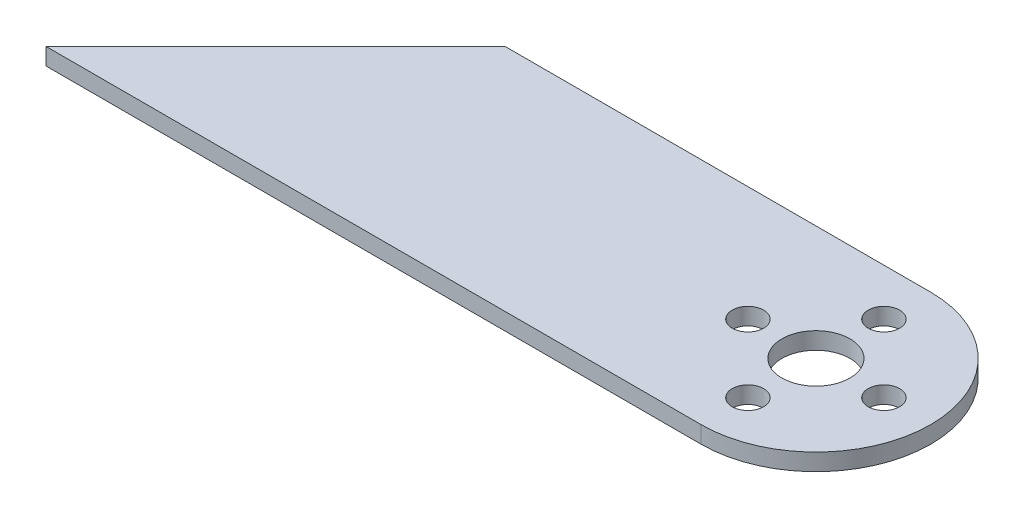
ISO-10303-21;
HEADER;
FILE_DESCRIPTION(('STEP AP214'),'2;1');
FILE_NAME('part.step','',(''),(''),'','','');
FILE_SCHEMA(('AUTOMOTIVE_DESIGN { 1 0 10303 214 1 1 1 1 }'));
ENDSEC;
DATA;
#1=APPLICATION_CONTEXT('core data for automotive mechanical design processes');
#2=APPLICATION_PROTOCOL_DEFINITION('international standard','automotive_design',2000,#1);
#3=PRODUCT_CONTEXT('',#1,'mechanical');
#4=PRODUCT('Part','Part','',(#3));
#5=PRODUCT_RELATED_PRODUCT_CATEGORY('part','',(#4));
#6=PRODUCT_DEFINITION_FORMATION('','',#4);
#7=PRODUCT_DEFINITION_CONTEXT('part definition',#1,'design');
#8=PRODUCT_DEFINITION('design','',#6,#7);
#9=PRODUCT_DEFINITION_SHAPE('','',#8);
#10=(LENGTH_UNIT() NAMED_UNIT(*) SI_UNIT(.MILLI.,.METRE.));
#11=(NAMED_UNIT(*) PLANE_ANGLE_UNIT() SI_UNIT($,.RADIAN.));
#12=(NAMED_UNIT(*) SI_UNIT($,.STERADIAN.) SOLID_ANGLE_UNIT());
#13=UNCERTAINTY_MEASURE_WITH_UNIT(LENGTH_MEASURE(1.E-05),#10,'distance_accuracy_value','');
#14=(GEOMETRIC_REPRESENTATION_CONTEXT(3) GLOBAL_UNCERTAINTY_ASSIGNED_CONTEXT((#13)) GLOBAL_UNIT_ASSIGNED_CONTEXT((#10,
#11,#12)) REPRESENTATION_CONTEXT('',''));
#15=CARTESIAN_POINT('',(0.,0.,0.));
#16=DIRECTION('',(0.,0.,1.));
#17=DIRECTION('',(1.,0.,0.));
#18=AXIS2_PLACEMENT_3D('',#15,#16,#17);
#19=CARTESIAN_POINT('',(0.,2.,0.));
#20=DIRECTION('',(0.,1.,0.));
#21=DIRECTION('',(0.,0.,1.));
#22=AXIS2_PLACEMENT_3D('',#19,#20,#21);
#23=PLANE('',#22);
#24=DIRECTION('',(-1.,0.,0.));
#25=VECTOR('',#24,1.);
#26=CARTESIAN_POINT('',(64.,2.,-13.5));
#27=LINE('',#26,#25);
#28=CARTESIAN_POINT('',(13.9239669501023,2.,-13.5));
#29=VERTEX_POINT('',#28);
#30=CARTESIAN_POINT('',(64.,2.,-13.5));
#31=VERTEX_POINT('',#30);
#32=EDGE_CURVE('E99',#29,#31,#27,.F.);
#33=ORIENTED_EDGE('',*,*,#32,.F.);
#34=DIRECTION('',(-0.707106781186547,0.,0.707106781186547));
#35=VECTOR('',#34,1.);
#36=CARTESIAN_POINT('',(-13.0760330498977,2.,13.5));
#37=LINE('',#36,#35);
#38=CARTESIAN_POINT('',(-13.0760330498977,2.,13.5));
#39=VERTEX_POINT('',#38);
#40=EDGE_CURVE('E94',#29,#39,#37,.T.);
#41=ORIENTED_EDGE('',*,*,#40,.T.);
#42=DIRECTION('',(1.,0.,0.));
#43=VECTOR('',#42,1.);
#44=CARTESIAN_POINT('',(0.,2.,13.5));
#45=LINE('',#44,#43);
#46=CARTESIAN_POINT('',(64.,2.,13.5));
#47=VERTEX_POINT('',#46);
#48=EDGE_CURVE('E82',#47,#39,#45,.F.);
#49=ORIENTED_EDGE('',*,*,#48,.F.);
#50=CARTESIAN_POINT('',(64.,2.,0.));
#51=DIRECTION('',(0.,1.,0.));
#52=DIRECTION('',(0.,0.,1.));
#53=AXIS2_PLACEMENT_3D('',#50,#51,#52);
#54=CIRCLE('',#53,13.5);
#55=EDGE_CURVE('E39',#31,#47,#54,.F.);
#56=ORIENTED_EDGE('',*,*,#55,.F.);
#57=EDGE_LOOP('',(#33,#41,#49,#56));
#58=FACE_BOUND('',#57,.T.);
#59=CARTESIAN_POINT('',(56.,2.,0.));
#60=DIRECTION('',(0.,1.,0.));
#61=DIRECTION('',(0.,0.,1.));
#62=AXIS2_PLACEMENT_3D('',#59,#60,#61);
#63=CIRCLE('',#62,1.85);
#64=CARTESIAN_POINT('',(56.,2.,1.85));
#65=VERTEX_POINT('',#64);
#66=EDGE_CURVE('E109',#65,#65,#63,.F.);
#67=ORIENTED_EDGE('',*,*,#66,.T.);
#68=EDGE_LOOP('',(#67));
#69=FACE_BOUND('',#68,.T.);
#70=CARTESIAN_POINT('',(64.,2.,8.));
#71=DIRECTION('',(0.,1.,0.));
#72=DIRECTION('',(0.,0.,1.));
#73=AXIS2_PLACEMENT_3D('',#70,#71,#72);
#74=CIRCLE('',#73,1.85);
#75=CARTESIAN_POINT('',(64.,2.,9.85));
#76=VERTEX_POINT('',#75);
#77=EDGE_CURVE('E128',#76,#76,#74,.F.);
#78=ORIENTED_EDGE('',*,*,#77,.T.);
#79=EDGE_LOOP('',(#78));
#80=FACE_BOUND('',#79,.T.);
#81=CARTESIAN_POINT('',(72.,2.,0.));
#82=DIRECTION('',(0.,1.,0.));
#83=DIRECTION('',(0.,0.,1.));
#84=AXIS2_PLACEMENT_3D('',#81,#82,#83);
#85=CIRCLE('',#84,1.85);
#86=CARTESIAN_POINT('',(72.,2.,1.85));
#87=VERTEX_POINT('',#86);
#88=EDGE_CURVE('E131',#87,#87,#85,.F.);
#89=ORIENTED_EDGE('',*,*,#88,.T.);
#90=EDGE_LOOP('',(#89));
#91=FACE_BOUND('',#90,.T.);
#92=CARTESIAN_POINT('',(64.,2.,-8.));
#93=DIRECTION('',(0.,1.,0.));
#94=DIRECTION('',(0.,0.,1.));
#95=AXIS2_PLACEMENT_3D('',#92,#93,#94);
#96=CIRCLE('',#95,1.85);
#97=CARTESIAN_POINT('',(64.,2.,-6.15));
#98=VERTEX_POINT('',#97);
#99=EDGE_CURVE('E134',#98,#98,#96,.F.);
#100=ORIENTED_EDGE('',*,*,#99,.T.);
#101=EDGE_LOOP('',(#100));
#102=FACE_BOUND('',#101,.T.);
#103=CARTESIAN_POINT('',(64.,2.,0.));
#104=DIRECTION('',(0.,1.,0.));
#105=DIRECTION('',(0.,0.,1.));
#106=AXIS2_PLACEMENT_3D('',#103,#104,#105);
#107=CIRCLE('',#106,4.);
#108=CARTESIAN_POINT('',(64.,2.,4.));
#109=VERTEX_POINT('',#108);
#110=EDGE_CURVE('E111',#109,#109,#107,.F.);
#111=ORIENTED_EDGE('',*,*,#110,.T.);
#112=EDGE_LOOP('',(#111));
#113=FACE_BOUND('',#112,.T.);
#114=ADVANCED_FACE('F36',(#58,#69,#80,#91,#102,#113),#23,.T.);
#115=CARTESIAN_POINT('',(0.,0.,13.5));
#116=DIRECTION('',(0.,0.,1.));
#117=DIRECTION('',(1.,0.,0.));
#118=AXIS2_PLACEMENT_3D('',#115,#116,#117);
#119=PLANE('',#118);
#120=ORIENTED_EDGE('',*,*,#48,.T.);
#121=DIRECTION('',(0.,1.,0.));
#122=VECTOR('',#121,1.);
#123=CARTESIAN_POINT('',(-13.0760330498977,0.,13.5));
#124=LINE('',#123,#122);
#125=CARTESIAN_POINT('',(-13.0760330498977,0.,13.5));
#126=VERTEX_POINT('',#125);
#127=EDGE_CURVE('E85',#126,#39,#124,.T.);
#128=ORIENTED_EDGE('',*,*,#127,.F.);
#129=DIRECTION('',(1.,0.,0.));
#130=VECTOR('',#129,1.);
#131=CARTESIAN_POINT('',(0.,0.,13.5));
#132=LINE('',#131,#130);
#133=CARTESIAN_POINT('',(64.,0.,13.5));
#134=VERTEX_POINT('',#133);
#135=EDGE_CURVE('E107',#126,#134,#132,.T.);
#136=ORIENTED_EDGE('',*,*,#135,.T.);
#137=DIRECTION('',(0.,1.,0.));
#138=VECTOR('',#137,1.);
#139=CARTESIAN_POINT('',(64.,0.,13.5));
#140=LINE('',#139,#138);
#141=EDGE_CURVE('E87',#47,#134,#140,.F.);
#142=ORIENTED_EDGE('',*,*,#141,.F.);
#143=EDGE_LOOP('',(#120,#128,#136,#142));
#144=FACE_BOUND('',#143,.T.);
#145=ADVANCED_FACE('F84',(#144),#119,.T.);
#146=CARTESIAN_POINT('',(64.,0.,0.));
#147=DIRECTION('',(0.,1.,0.));
#148=DIRECTION('',(0.,0.,1.));
#149=AXIS2_PLACEMENT_3D('',#146,#147,#148);
#150=CYLINDRICAL_SURFACE('',#149,13.5);
#151=ORIENTED_EDGE('',*,*,#55,.T.);
#152=ORIENTED_EDGE('',*,*,#141,.T.);
#153=CARTESIAN_POINT('',(64.,0.,0.));
#154=DIRECTION('',(0.,1.,0.));
#155=DIRECTION('',(0.,0.,1.));
#156=AXIS2_PLACEMENT_3D('',#153,#154,#155);
#157=CIRCLE('',#156,13.5);
#158=CARTESIAN_POINT('',(64.,0.,-13.5));
#159=VERTEX_POINT('',#158);
#160=EDGE_CURVE('E106',#134,#159,#157,.T.);
#161=ORIENTED_EDGE('',*,*,#160,.T.);
#162=DIRECTION('',(0.,1.,0.));
#163=VECTOR('',#162,1.);
#164=CARTESIAN_POINT('',(64.,0.,-13.5));
#165=LINE('',#164,#163);
#166=EDGE_CURVE('E58',#31,#159,#165,.F.);
#167=ORIENTED_EDGE('',*,*,#166,.F.);
#168=EDGE_LOOP('',(#151,#152,#161,#167));
#169=FACE_BOUND('',#168,.T.);
#170=ADVANCED_FACE('F155',(#169),#150,.T.);
#171=CARTESIAN_POINT('',(64.,0.,-13.5));
#172=DIRECTION('',(0.,0.,-1.));
#173=DIRECTION('',(-1.,0.,0.));
#174=AXIS2_PLACEMENT_3D('',#171,#172,#173);
#175=PLANE('',#174);
#176=DIRECTION('',(0.,1.,0.));
#177=VECTOR('',#176,1.);
#178=CARTESIAN_POINT('',(13.9239669501023,0.,-13.5));
#179=LINE('',#178,#177);
#180=CARTESIAN_POINT('',(13.9239669501023,0.,-13.5));
#181=VERTEX_POINT('',#180);
#182=EDGE_CURVE('E72',#181,#29,#179,.T.);
#183=ORIENTED_EDGE('',*,*,#182,.T.);
#184=ORIENTED_EDGE('',*,*,#32,.T.);
#185=ORIENTED_EDGE('',*,*,#166,.T.);
#186=DIRECTION('',(1.,0.,0.));
#187=VECTOR('',#186,1.);
#188=CARTESIAN_POINT('',(0.,0.,-13.5));
#189=LINE('',#188,#187);
#190=EDGE_CURVE('E52',#159,#181,#189,.F.);
#191=ORIENTED_EDGE('',*,*,#190,.T.);
#192=EDGE_LOOP('',(#183,#184,#185,#191));
#193=FACE_BOUND('',#192,.T.);
#194=ADVANCED_FACE('F144',(#193),#175,.T.);
#195=CARTESIAN_POINT('',(64.,0.,0.));
#196=DIRECTION('',(0.,1.,0.));
#197=DIRECTION('',(0.,0.,1.));
#198=AXIS2_PLACEMENT_3D('',#195,#196,#197);
#199=CYLINDRICAL_SURFACE('',#198,4.);
#200=ORIENTED_EDGE('',*,*,#110,.F.);
#201=EDGE_LOOP('',(#200));
#202=FACE_BOUND('',#201,.T.);
#203=CARTESIAN_POINT('',(64.,0.,0.));
#204=DIRECTION('',(0.,1.,0.));
#205=DIRECTION('',(0.,0.,1.));
#206=AXIS2_PLACEMENT_3D('',#203,#204,#205);
#207=CIRCLE('',#206,4.);
#208=CARTESIAN_POINT('',(64.,0.,4.));
#209=VERTEX_POINT('',#208);
#210=EDGE_CURVE('E105',#209,#209,#207,.F.);
#211=ORIENTED_EDGE('',*,*,#210,.T.);
#212=EDGE_LOOP('',(#211));
#213=FACE_BOUND('',#212,.T.);
#214=ADVANCED_FACE('F140',(#202,#213),#199,.F.);
#215=CARTESIAN_POINT('',(64.,0.,-8.));
#216=DIRECTION('',(0.,1.,0.));
#217=DIRECTION('',(0.,0.,1.));
#218=AXIS2_PLACEMENT_3D('',#215,#216,#217);
#219=CYLINDRICAL_SURFACE('',#218,1.85);
#220=ORIENTED_EDGE('',*,*,#99,.F.);
#221=EDGE_LOOP('',(#220));
#222=FACE_BOUND('',#221,.T.);
#223=CARTESIAN_POINT('',(64.,0.,-8.));
#224=DIRECTION('',(0.,1.,0.));
#225=DIRECTION('',(0.,0.,1.));
#226=AXIS2_PLACEMENT_3D('',#223,#224,#225);
#227=CIRCLE('',#226,1.85);
#228=CARTESIAN_POINT('',(64.,0.,-6.15));
#229=VERTEX_POINT('',#228);
#230=EDGE_CURVE('E119',#229,#229,#227,.F.);
#231=ORIENTED_EDGE('',*,*,#230,.T.);
#232=EDGE_LOOP('',(#231));
#233=FACE_BOUND('',#232,.T.);
#234=ADVANCED_FACE('F143',(#222,#233),#219,.F.);
#235=CARTESIAN_POINT('',(72.,0.,0.));
#236=DIRECTION('',(0.,1.,0.));
#237=DIRECTION('',(0.,0.,1.));
#238=AXIS2_PLACEMENT_3D('',#235,#236,#237);
#239=CYLINDRICAL_SURFACE('',#238,1.85);
#240=ORIENTED_EDGE('',*,*,#88,.F.);
#241=EDGE_LOOP('',(#240));
#242=FACE_BOUND('',#241,.T.);
#243=CARTESIAN_POINT('',(72.,0.,0.));
#244=DIRECTION('',(0.,1.,0.));
#245=DIRECTION('',(0.,0.,1.));
#246=AXIS2_PLACEMENT_3D('',#243,#244,#245);
#247=CIRCLE('',#246,1.85);
#248=CARTESIAN_POINT('',(72.,0.,1.85));
#249=VERTEX_POINT('',#248);
#250=EDGE_CURVE('E116',#249,#249,#247,.F.);
#251=ORIENTED_EDGE('',*,*,#250,.T.);
#252=EDGE_LOOP('',(#251));
#253=FACE_BOUND('',#252,.T.);
#254=ADVANCED_FACE('F169',(#242,#253),#239,.F.);
#255=CARTESIAN_POINT('',(64.,0.,8.));
#256=DIRECTION('',(0.,1.,0.));
#257=DIRECTION('',(0.,0.,1.));
#258=AXIS2_PLACEMENT_3D('',#255,#256,#257);
#259=CYLINDRICAL_SURFACE('',#258,1.85);
#260=ORIENTED_EDGE('',*,*,#77,.F.);
#261=EDGE_LOOP('',(#260));
#262=FACE_BOUND('',#261,.T.);
#263=CARTESIAN_POINT('',(64.,0.,8.));
#264=DIRECTION('',(0.,1.,0.));
#265=DIRECTION('',(0.,0.,1.));
#266=AXIS2_PLACEMENT_3D('',#263,#264,#265);
#267=CIRCLE('',#266,1.85);
#268=CARTESIAN_POINT('',(64.,0.,9.85));
#269=VERTEX_POINT('',#268);
#270=EDGE_CURVE('E44',#269,#269,#267,.F.);
#271=ORIENTED_EDGE('',*,*,#270,.T.);
#272=EDGE_LOOP('',(#271));
#273=FACE_BOUND('',#272,.T.);
#274=ADVANCED_FACE('F173',(#262,#273),#259,.F.);
#275=CARTESIAN_POINT('',(56.,0.,0.));
#276=DIRECTION('',(0.,1.,0.));
#277=DIRECTION('',(0.,0.,1.));
#278=AXIS2_PLACEMENT_3D('',#275,#276,#277);
#279=CYLINDRICAL_SURFACE('',#278,1.85);
#280=ORIENTED_EDGE('',*,*,#66,.F.);
#281=EDGE_LOOP('',(#280));
#282=FACE_BOUND('',#281,.T.);
#283=CARTESIAN_POINT('',(56.,0.,0.));
#284=DIRECTION('',(0.,1.,0.));
#285=DIRECTION('',(0.,0.,1.));
#286=AXIS2_PLACEMENT_3D('',#283,#284,#285);
#287=CIRCLE('',#286,1.85);
#288=CARTESIAN_POINT('',(56.,0.,1.85));
#289=VERTEX_POINT('',#288);
#290=EDGE_CURVE('E11',#289,#289,#287,.F.);
#291=ORIENTED_EDGE('',*,*,#290,.T.);
#292=EDGE_LOOP('',(#291));
#293=FACE_BOUND('',#292,.T.);
#294=ADVANCED_FACE('F151',(#282,#293),#279,.F.);
#295=CARTESIAN_POINT('',(0.,0.,0.));
#296=DIRECTION('',(0.,1.,0.));
#297=DIRECTION('',(0.,0.,1.));
#298=AXIS2_PLACEMENT_3D('',#295,#296,#297);
#299=PLANE('',#298);
#300=ORIENTED_EDGE('',*,*,#290,.F.);
#301=EDGE_LOOP('',(#300));
#302=FACE_BOUND('',#301,.T.);
#303=ORIENTED_EDGE('',*,*,#270,.F.);
#304=EDGE_LOOP('',(#303));
#305=FACE_BOUND('',#304,.T.);
#306=ORIENTED_EDGE('',*,*,#250,.F.);
#307=EDGE_LOOP('',(#306));
#308=FACE_BOUND('',#307,.T.);
#309=ORIENTED_EDGE('',*,*,#230,.F.);
#310=EDGE_LOOP('',(#309));
#311=FACE_BOUND('',#310,.T.);
#312=ORIENTED_EDGE('',*,*,#210,.F.);
#313=EDGE_LOOP('',(#312));
#314=FACE_BOUND('',#313,.T.);
#315=ORIENTED_EDGE('',*,*,#135,.F.);
#316=DIRECTION('',(-0.707106781186547,0.,0.707106781186547));
#317=VECTOR('',#316,1.);
#318=CARTESIAN_POINT('',(-13.0760330498977,0.,13.5));
#319=LINE('',#318,#317);
#320=EDGE_CURVE('E96',#181,#126,#319,.T.);
#321=ORIENTED_EDGE('',*,*,#320,.F.);
#322=ORIENTED_EDGE('',*,*,#190,.F.);
#323=ORIENTED_EDGE('',*,*,#160,.F.);
#324=EDGE_LOOP('',(#315,#321,#322,#323));
#325=FACE_BOUND('',#324,.T.);
#326=ADVANCED_FACE('F148',(#302,#305,#308,#311,#314,#325),#299,.F.);
#327=CARTESIAN_POINT('',(-13.0760330498977,0.,13.5));
#328=DIRECTION('',(-0.707106781186547,0.,-0.707106781186547));
#329=DIRECTION('',(-0.707106781186548,0.,0.707106781186548));
#330=AXIS2_PLACEMENT_3D('',#327,#328,#329);
#331=PLANE('',#330);
#332=ORIENTED_EDGE('',*,*,#40,.F.);
#333=ORIENTED_EDGE('',*,*,#182,.F.);
#334=ORIENTED_EDGE('',*,*,#320,.T.);
#335=ORIENTED_EDGE('',*,*,#127,.T.);
#336=EDGE_LOOP('',(#332,#333,#334,#335));
#337=FACE_BOUND('',#336,.T.);
#338=ADVANCED_FACE('F93',(#337),#331,.T.);
#339=CLOSED_SHELL('',(#114,#145,#170,#194,#214,#234,#254,#274,#294,#326,#338));
#340=MANIFOLD_SOLID_BREP('B2',#339);
#341=ADVANCED_BREP_SHAPE_REPRESENTATION('',(#18,#340),#14);
#342=SHAPE_DEFINITION_REPRESENTATION(#9,#341);
ENDSEC;
END-ISO-10303-21;
